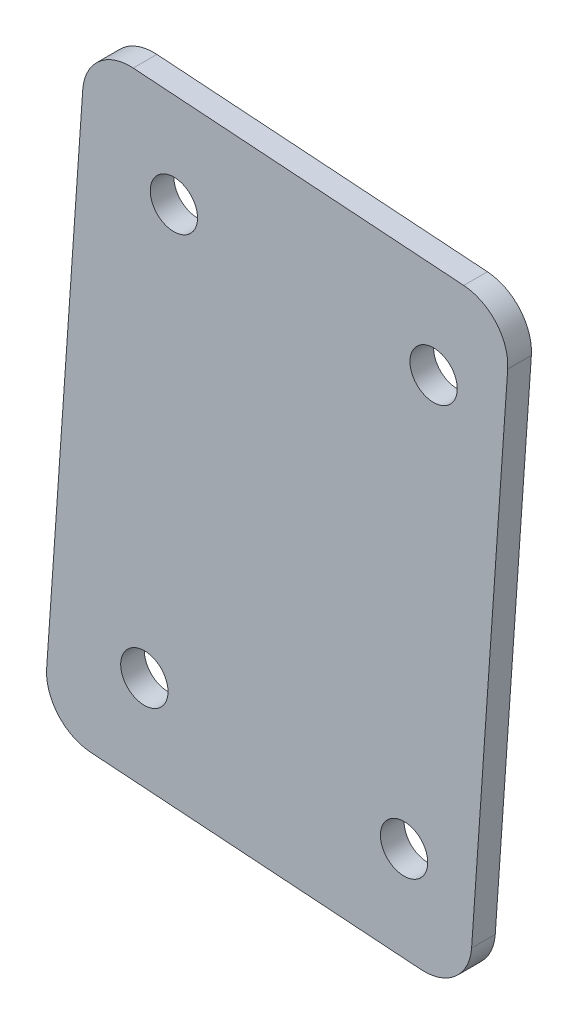
ISO-10303-21;
HEADER;
FILE_DESCRIPTION(('STEP AP214'),'2;1');
FILE_NAME('part.step','',(''),(''),'','','');
FILE_SCHEMA(('AUTOMOTIVE_DESIGN { 1 0 10303 214 1 1 1 1 }'));
ENDSEC;
DATA;
#1=APPLICATION_CONTEXT('core data for automotive mechanical design processes');
#2=APPLICATION_PROTOCOL_DEFINITION('international standard','automotive_design',2000,#1);
#3=PRODUCT_CONTEXT('',#1,'mechanical');
#4=PRODUCT('Part','Part','',(#3));
#5=PRODUCT_RELATED_PRODUCT_CATEGORY('part','',(#4));
#6=PRODUCT_DEFINITION_FORMATION('','',#4);
#7=PRODUCT_DEFINITION_CONTEXT('part definition',#1,'design');
#8=PRODUCT_DEFINITION('design','',#6,#7);
#9=PRODUCT_DEFINITION_SHAPE('','',#8);
#10=(LENGTH_UNIT() NAMED_UNIT(*) SI_UNIT(.MILLI.,.METRE.));
#11=(NAMED_UNIT(*) PLANE_ANGLE_UNIT() SI_UNIT($,.RADIAN.));
#12=(NAMED_UNIT(*) SI_UNIT($,.STERADIAN.) SOLID_ANGLE_UNIT());
#13=UNCERTAINTY_MEASURE_WITH_UNIT(LENGTH_MEASURE(1.E-05),#10,'distance_accuracy_value','');
#14=(GEOMETRIC_REPRESENTATION_CONTEXT(3) GLOBAL_UNCERTAINTY_ASSIGNED_CONTEXT((#13)) GLOBAL_UNIT_ASSIGNED_CONTEXT((#10,
#11,#12)) REPRESENTATION_CONTEXT('',''));
#15=CARTESIAN_POINT('',(0.,0.,0.));
#16=DIRECTION('',(0.,0.,1.));
#17=DIRECTION('',(1.,0.,0.));
#18=AXIS2_PLACEMENT_3D('',#15,#16,#17);
#19=CARTESIAN_POINT('',(0.,0.,3.175));
#20=DIRECTION('',(0.,0.,1.));
#21=DIRECTION('',(1.,0.,0.));
#22=AXIS2_PLACEMENT_3D('',#19,#20,#21);
#23=PLANE('',#22);
#24=CARTESIAN_POINT('',(-345.573737165275,274.679259269861,3.175));
#25=DIRECTION('',(0.,0.,1.));
#26=DIRECTION('',(1.,0.,0.));
#27=AXIS2_PLACEMENT_3D('',#24,#25,#26);
#28=CIRCLE('',#27,3.17500000000002);
#29=CARTESIAN_POINT('',(-342.398737165275,274.679259269861,3.175));
#30=VERTEX_POINT('',#29);
#31=EDGE_CURVE('E213',#30,#30,#28,.T.);
#32=ORIENTED_EDGE('',*,*,#31,.F.);
#33=EDGE_LOOP('',(#32));
#34=FACE_BOUND('',#33,.T.);
#35=CARTESIAN_POINT('',(-306.771270756679,329.270895310648,3.175));
#36=DIRECTION('',(0.,0.,1.));
#37=DIRECTION('',(1.,0.,0.));
#38=AXIS2_PLACEMENT_3D('',#35,#36,#37);
#39=CIRCLE('',#38,3.17499999999997);
#40=CARTESIAN_POINT('',(-303.596270756679,329.270895310648,3.175));
#41=VERTEX_POINT('',#40);
#42=EDGE_CURVE('E189',#41,#41,#39,.T.);
#43=ORIENTED_EDGE('',*,*,#42,.F.);
#44=EDGE_LOOP('',(#43));
#45=FACE_BOUND('',#44,.T.);
#46=DIRECTION('',(0.0693171008801701,0.997594676973353,0.));
#47=VECTOR('',#46,1.);
#48=CARTESIAN_POINT('',(-296.38885427733,341.280102322326,3.175));
#49=LINE('',#48,#47);
#50=CARTESIAN_POINT('',(-301.670817364398,265.263387936956,3.175));
#51=VERTEX_POINT('',#50);
#52=CARTESIAN_POINT('',(-296.829017867919,334.945376123545,3.175));
#53=VERTEX_POINT('',#52);
#54=EDGE_CURVE('E199',#51,#53,#49,.T.);
#55=ORIENTED_EDGE('',*,*,#54,.T.);
#56=CARTESIAN_POINT('',(-303.163744066699,335.385539714134,3.175));
#57=DIRECTION('',(0.,0.,1.));
#58=DIRECTION('',(1.,0.,0.));
#59=AXIS2_PLACEMENT_3D('',#56,#57,#58);
#60=CIRCLE('',#59,6.35);
#61=CARTESIAN_POINT('',(-302.72358047611,341.720265912915,3.175));
#62=VERTEX_POINT('',#61);
#63=EDGE_CURVE('E168',#53,#62,#60,.T.);
#64=ORIENTED_EDGE('',*,*,#63,.T.);
#65=DIRECTION('',(-0.997594676973353,0.0693171008801706,0.));
#66=VECTOR('',#65,1.);
#67=CARTESIAN_POINT('',(-353.401390066357,345.241574637627,3.175));
#68=LINE('',#67,#66);
#69=CARTESIAN_POINT('',(-347.066663867576,344.801411047038,3.175));
#70=VERTEX_POINT('',#69);
#71=EDGE_CURVE('E126',#62,#70,#68,.T.);
#72=ORIENTED_EDGE('',*,*,#71,.T.);
#73=CARTESIAN_POINT('',(-347.506827458165,338.466684848258,3.175));
#74=DIRECTION('',(0.,0.,1.));
#75=DIRECTION('',(1.,0.,0.));
#76=AXIS2_PLACEMENT_3D('',#73,#74,#75);
#77=CIRCLE('',#76,6.35);
#78=CARTESIAN_POINT('',(-353.841553656946,338.906848438847,3.175));
#79=VERTEX_POINT('',#78);
#80=EDGE_CURVE('E161',#70,#79,#77,.T.);
#81=ORIENTED_EDGE('',*,*,#80,.T.);
#82=DIRECTION('',(-0.0693171008801701,-0.997594676973353,0.));
#83=VECTOR('',#82,1.);
#84=CARTESIAN_POINT('',(-353.401390066357,345.241574637627,3.175));
#85=LINE('',#84,#83);
#86=CARTESIAN_POINT('',(-358.683353153426,269.224860252258,3.175));
#87=VERTEX_POINT('',#86);
#88=EDGE_CURVE('E135',#79,#87,#85,.T.);
#89=ORIENTED_EDGE('',*,*,#88,.T.);
#90=CARTESIAN_POINT('',(-352.348626954645,268.784696661669,3.175));
#91=DIRECTION('',(0.,0.,1.));
#92=DIRECTION('',(1.,0.,0.));
#93=AXIS2_PLACEMENT_3D('',#90,#91,#92);
#94=CIRCLE('',#93,6.35);
#95=CARTESIAN_POINT('',(-352.788790545234,262.449970462888,3.175));
#96=VERTEX_POINT('',#95);
#97=EDGE_CURVE('E61',#87,#96,#94,.T.);
#98=ORIENTED_EDGE('',*,*,#97,.T.);
#99=DIRECTION('',(0.997594676973353,-0.0693171008801706,0.));
#100=VECTOR('',#99,1.);
#101=CARTESIAN_POINT('',(-359.123516744015,262.890134053477,3.175));
#102=LINE('',#101,#100);
#103=CARTESIAN_POINT('',(-308.445707153768,259.368825328765,3.175));
#104=VERTEX_POINT('',#103);
#105=EDGE_CURVE('E140',#96,#104,#102,.T.);
#106=ORIENTED_EDGE('',*,*,#105,.T.);
#107=CARTESIAN_POINT('',(-308.005543563179,265.703551527545,3.175));
#108=DIRECTION('',(0.,0.,1.));
#109=DIRECTION('',(1.,0.,0.));
#110=AXIS2_PLACEMENT_3D('',#107,#108,#109);
#111=CIRCLE('',#110,6.35);
#112=EDGE_CURVE('E166',#104,#51,#111,.T.);
#113=ORIENTED_EDGE('',*,*,#112,.T.);
#114=EDGE_LOOP('',(#55,#64,#72,#81,#89,#98,#106,#113));
#115=FACE_BOUND('',#114,.T.);
#116=CARTESIAN_POINT('',(-341.612264849973,331.691795058888,3.175));
#117=DIRECTION('',(0.,0.,1.));
#118=DIRECTION('',(1.,0.,0.));
#119=AXIS2_PLACEMENT_3D('',#116,#117,#118);
#120=CIRCLE('',#119,3.17500000000002);
#121=CARTESIAN_POINT('',(-338.437264849973,331.691795058888,3.175));
#122=VERTEX_POINT('',#121);
#123=EDGE_CURVE('E207',#122,#122,#120,.T.);
#124=ORIENTED_EDGE('',*,*,#123,.F.);
#125=EDGE_LOOP('',(#124));
#126=FACE_BOUND('',#125,.T.);
#127=CARTESIAN_POINT('',(-310.732743071981,272.258359521621,3.175));
#128=DIRECTION('',(0.,0.,1.));
#129=DIRECTION('',(1.,0.,0.));
#130=AXIS2_PLACEMENT_3D('',#127,#128,#129);
#131=CIRCLE('',#130,3.17500000000002);
#132=CARTESIAN_POINT('',(-307.55774307198,272.258359521621,3.175));
#133=VERTEX_POINT('',#132);
#134=EDGE_CURVE('E221',#133,#133,#131,.T.);
#135=ORIENTED_EDGE('',*,*,#134,.F.);
#136=EDGE_LOOP('',(#135));
#137=FACE_BOUND('',#136,.T.);
#138=ADVANCED_FACE('F38',(#34,#45,#115,#126,#137),#23,.T.);
#139=CARTESIAN_POINT('',(0.,0.,0.));
#140=DIRECTION('',(0.,0.,1.));
#141=DIRECTION('',(1.,0.,0.));
#142=AXIS2_PLACEMENT_3D('',#139,#140,#141);
#143=PLANE('',#142);
#144=DIRECTION('',(-0.997594676973353,0.0693171008801706,0.));
#145=VECTOR('',#144,1.);
#146=CARTESIAN_POINT('',(-353.401390066357,345.241574637627,0.));
#147=LINE('',#146,#145);
#148=CARTESIAN_POINT('',(-302.72358047611,341.720265912915,0.));
#149=VERTEX_POINT('',#148);
#150=CARTESIAN_POINT('',(-347.066663867576,344.801411047038,0.));
#151=VERTEX_POINT('',#150);
#152=EDGE_CURVE('E123',#149,#151,#147,.T.);
#153=ORIENTED_EDGE('',*,*,#152,.F.);
#154=CARTESIAN_POINT('',(-303.163744066699,335.385539714134,0.));
#155=DIRECTION('',(0.,0.,1.));
#156=DIRECTION('',(1.,0.,0.));
#157=AXIS2_PLACEMENT_3D('',#154,#155,#156);
#158=CIRCLE('',#157,6.35);
#159=CARTESIAN_POINT('',(-296.829017867919,334.945376123545,0.));
#160=VERTEX_POINT('',#159);
#161=EDGE_CURVE('E105',#149,#160,#158,.F.);
#162=ORIENTED_EDGE('',*,*,#161,.T.);
#163=DIRECTION('',(0.0693171008801701,0.997594676973353,0.));
#164=VECTOR('',#163,1.);
#165=CARTESIAN_POINT('',(-296.38885427733,341.280102322326,0.));
#166=LINE('',#165,#164);
#167=CARTESIAN_POINT('',(-301.670817364398,265.263387936956,0.));
#168=VERTEX_POINT('',#167);
#169=EDGE_CURVE('E136',#168,#160,#166,.T.);
#170=ORIENTED_EDGE('',*,*,#169,.F.);
#171=CARTESIAN_POINT('',(-308.005543563179,265.703551527545,0.));
#172=DIRECTION('',(0.,0.,1.));
#173=DIRECTION('',(1.,0.,0.));
#174=AXIS2_PLACEMENT_3D('',#171,#172,#173);
#175=CIRCLE('',#174,6.35);
#176=CARTESIAN_POINT('',(-308.445707153768,259.368825328765,0.));
#177=VERTEX_POINT('',#176);
#178=EDGE_CURVE('E117',#168,#177,#175,.F.);
#179=ORIENTED_EDGE('',*,*,#178,.T.);
#180=DIRECTION('',(0.997594676973353,-0.0693171008801706,0.));
#181=VECTOR('',#180,1.);
#182=CARTESIAN_POINT('',(-359.123516744015,262.890134053477,0.));
#183=LINE('',#182,#181);
#184=CARTESIAN_POINT('',(-352.788790545234,262.449970462888,0.));
#185=VERTEX_POINT('',#184);
#186=EDGE_CURVE('E143',#185,#177,#183,.T.);
#187=ORIENTED_EDGE('',*,*,#186,.F.);
#188=CARTESIAN_POINT('',(-352.348626954645,268.784696661669,0.));
#189=DIRECTION('',(0.,0.,1.));
#190=DIRECTION('',(1.,0.,0.));
#191=AXIS2_PLACEMENT_3D('',#188,#189,#190);
#192=CIRCLE('',#191,6.35);
#193=CARTESIAN_POINT('',(-358.683353153426,269.224860252258,0.));
#194=VERTEX_POINT('',#193);
#195=EDGE_CURVE('E151',#185,#194,#192,.F.);
#196=ORIENTED_EDGE('',*,*,#195,.T.);
#197=DIRECTION('',(-0.0693171008801701,-0.997594676973353,0.));
#198=VECTOR('',#197,1.);
#199=CARTESIAN_POINT('',(-353.401390066357,345.241574637627,0.));
#200=LINE('',#199,#198);
#201=CARTESIAN_POINT('',(-353.841553656946,338.906848438847,0.));
#202=VERTEX_POINT('',#201);
#203=EDGE_CURVE('E183',#202,#194,#200,.T.);
#204=ORIENTED_EDGE('',*,*,#203,.F.);
#205=CARTESIAN_POINT('',(-347.506827458165,338.466684848258,0.));
#206=DIRECTION('',(0.,0.,1.));
#207=DIRECTION('',(1.,0.,0.));
#208=AXIS2_PLACEMENT_3D('',#205,#206,#207);
#209=CIRCLE('',#208,6.35);
#210=EDGE_CURVE('E128',#202,#151,#209,.F.);
#211=ORIENTED_EDGE('',*,*,#210,.T.);
#212=EDGE_LOOP('',(#153,#162,#170,#179,#187,#196,#204,#211));
#213=FACE_BOUND('',#212,.T.);
#214=CARTESIAN_POINT('',(-306.771270756679,329.270895310648,0.));
#215=DIRECTION('',(0.,0.,1.));
#216=DIRECTION('',(1.,0.,0.));
#217=AXIS2_PLACEMENT_3D('',#214,#215,#216);
#218=CIRCLE('',#217,3.17499999999997);
#219=CARTESIAN_POINT('',(-303.596270756679,329.270895310648,0.));
#220=VERTEX_POINT('',#219);
#221=EDGE_CURVE('E194',#220,#220,#218,.T.);
#222=ORIENTED_EDGE('',*,*,#221,.T.);
#223=EDGE_LOOP('',(#222));
#224=FACE_BOUND('',#223,.T.);
#225=CARTESIAN_POINT('',(-341.612264849973,331.691795058888,0.));
#226=DIRECTION('',(0.,0.,1.));
#227=DIRECTION('',(1.,0.,0.));
#228=AXIS2_PLACEMENT_3D('',#225,#226,#227);
#229=CIRCLE('',#228,3.17500000000002);
#230=CARTESIAN_POINT('',(-338.437264849973,331.691795058888,0.));
#231=VERTEX_POINT('',#230);
#232=EDGE_CURVE('E209',#231,#231,#229,.T.);
#233=ORIENTED_EDGE('',*,*,#232,.T.);
#234=EDGE_LOOP('',(#233));
#235=FACE_BOUND('',#234,.T.);
#236=CARTESIAN_POINT('',(-345.573737165275,274.679259269861,0.));
#237=DIRECTION('',(0.,0.,1.));
#238=DIRECTION('',(1.,0.,0.));
#239=AXIS2_PLACEMENT_3D('',#236,#237,#238);
#240=CIRCLE('',#239,3.17500000000002);
#241=CARTESIAN_POINT('',(-342.398737165275,274.679259269861,0.));
#242=VERTEX_POINT('',#241);
#243=EDGE_CURVE('E217',#242,#242,#240,.T.);
#244=ORIENTED_EDGE('',*,*,#243,.T.);
#245=EDGE_LOOP('',(#244));
#246=FACE_BOUND('',#245,.T.);
#247=CARTESIAN_POINT('',(-310.732743071981,272.258359521621,0.));
#248=DIRECTION('',(0.,0.,1.));
#249=DIRECTION('',(1.,0.,0.));
#250=AXIS2_PLACEMENT_3D('',#247,#248,#249);
#251=CIRCLE('',#250,3.17500000000002);
#252=CARTESIAN_POINT('',(-307.55774307198,272.258359521621,0.));
#253=VERTEX_POINT('',#252);
#254=EDGE_CURVE('E225',#253,#253,#251,.T.);
#255=ORIENTED_EDGE('',*,*,#254,.T.);
#256=EDGE_LOOP('',(#255));
#257=FACE_BOUND('',#256,.T.);
#258=ADVANCED_FACE('F131',(#213,#224,#235,#246,#257),#143,.F.);
#259=CARTESIAN_POINT('',(-353.401390066357,345.241574637627,3.175));
#260=DIRECTION('',(0.997594676973353,-0.0693171008801701,0.));
#261=DIRECTION('',(0.0693171008801701,0.997594676973353,0.));
#262=AXIS2_PLACEMENT_3D('',#259,#260,#261);
#263=PLANE('',#262);
#264=ORIENTED_EDGE('',*,*,#203,.T.);
#265=DIRECTION('',(0.,0.,-1.));
#266=VECTOR('',#265,1.);
#267=CARTESIAN_POINT('',(-358.683353153426,269.224860252258,3.175));
#268=LINE('',#267,#266);
#269=EDGE_CURVE('E11',#194,#87,#268,.F.);
#270=ORIENTED_EDGE('',*,*,#269,.T.);
#271=ORIENTED_EDGE('',*,*,#88,.F.);
#272=DIRECTION('',(0.,0.,-1.));
#273=VECTOR('',#272,1.);
#274=CARTESIAN_POINT('',(-353.841553656946,338.906848438847,3.175));
#275=LINE('',#274,#273);
#276=EDGE_CURVE('E47',#79,#202,#275,.T.);
#277=ORIENTED_EDGE('',*,*,#276,.T.);
#278=EDGE_LOOP('',(#264,#270,#271,#277));
#279=FACE_BOUND('',#278,.T.);
#280=ADVANCED_FACE('F182',(#279),#263,.F.);
#281=CARTESIAN_POINT('',(-359.123516744015,262.890134053477,3.175));
#282=DIRECTION('',(0.0693171008801706,0.997594676973353,0.));
#283=DIRECTION('',(-0.997594676973353,0.0693171008801706,0.));
#284=AXIS2_PLACEMENT_3D('',#281,#282,#283);
#285=PLANE('',#284);
#286=ORIENTED_EDGE('',*,*,#186,.T.);
#287=DIRECTION('',(0.,0.,-1.));
#288=VECTOR('',#287,1.);
#289=CARTESIAN_POINT('',(-308.445707153768,259.368825328765,3.175));
#290=LINE('',#289,#288);
#291=EDGE_CURVE('E54',#177,#104,#290,.F.);
#292=ORIENTED_EDGE('',*,*,#291,.T.);
#293=ORIENTED_EDGE('',*,*,#105,.F.);
#294=DIRECTION('',(0.,0.,-1.));
#295=VECTOR('',#294,1.);
#296=CARTESIAN_POINT('',(-352.788790545234,262.449970462888,3.175));
#297=LINE('',#296,#295);
#298=EDGE_CURVE('E171',#96,#185,#297,.T.);
#299=ORIENTED_EDGE('',*,*,#298,.T.);
#300=EDGE_LOOP('',(#286,#292,#293,#299));
#301=FACE_BOUND('',#300,.T.);
#302=ADVANCED_FACE('F254',(#301),#285,.F.);
#303=CARTESIAN_POINT('',(-296.38885427733,341.280102322326,3.175));
#304=DIRECTION('',(-0.997594676973353,0.0693171008801701,0.));
#305=DIRECTION('',(-0.0693171008801701,-0.997594676973353,0.));
#306=AXIS2_PLACEMENT_3D('',#303,#304,#305);
#307=PLANE('',#306);
#308=ORIENTED_EDGE('',*,*,#169,.T.);
#309=DIRECTION('',(0.,0.,-1.));
#310=VECTOR('',#309,1.);
#311=CARTESIAN_POINT('',(-296.829017867919,334.945376123545,3.175));
#312=LINE('',#311,#310);
#313=EDGE_CURVE('E110',#160,#53,#312,.F.);
#314=ORIENTED_EDGE('',*,*,#313,.T.);
#315=ORIENTED_EDGE('',*,*,#54,.F.);
#316=DIRECTION('',(0.,0.,-1.));
#317=VECTOR('',#316,1.);
#318=CARTESIAN_POINT('',(-301.670817364398,265.263387936956,3.175));
#319=LINE('',#318,#317);
#320=EDGE_CURVE('E116',#51,#168,#319,.T.);
#321=ORIENTED_EDGE('',*,*,#320,.T.);
#322=EDGE_LOOP('',(#308,#314,#315,#321));
#323=FACE_BOUND('',#322,.T.);
#324=ADVANCED_FACE('F251',(#323),#307,.F.);
#325=CARTESIAN_POINT('',(-353.401390066357,345.241574637627,3.175));
#326=DIRECTION('',(-0.0693171008801706,-0.997594676973353,0.));
#327=DIRECTION('',(0.997594676973353,-0.0693171008801706,0.));
#328=AXIS2_PLACEMENT_3D('',#325,#326,#327);
#329=PLANE('',#328);
#330=ORIENTED_EDGE('',*,*,#71,.F.);
#331=DIRECTION('',(0.,0.,-1.));
#332=VECTOR('',#331,1.);
#333=CARTESIAN_POINT('',(-302.72358047611,341.720265912915,3.175));
#334=LINE('',#333,#332);
#335=EDGE_CURVE('E109',#62,#149,#334,.T.);
#336=ORIENTED_EDGE('',*,*,#335,.T.);
#337=ORIENTED_EDGE('',*,*,#152,.T.);
#338=DIRECTION('',(0.,0.,-1.));
#339=VECTOR('',#338,1.);
#340=CARTESIAN_POINT('',(-347.066663867576,344.801411047038,3.175));
#341=LINE('',#340,#339);
#342=EDGE_CURVE('E129',#151,#70,#341,.F.);
#343=ORIENTED_EDGE('',*,*,#342,.T.);
#344=EDGE_LOOP('',(#330,#336,#337,#343));
#345=FACE_BOUND('',#344,.T.);
#346=ADVANCED_FACE('F122',(#345),#329,.F.);
#347=CARTESIAN_POINT('',(-306.771270756679,329.270895310648,3.175));
#348=DIRECTION('',(0.,0.,-1.));
#349=DIRECTION('',(-1.,0.,0.));
#350=AXIS2_PLACEMENT_3D('',#347,#348,#349);
#351=CYLINDRICAL_SURFACE('',#350,3.17499999999997);
#352=ORIENTED_EDGE('',*,*,#42,.T.);
#353=EDGE_LOOP('',(#352));
#354=FACE_BOUND('',#353,.T.);
#355=ORIENTED_EDGE('',*,*,#221,.F.);
#356=EDGE_LOOP('',(#355));
#357=FACE_BOUND('',#356,.T.);
#358=ADVANCED_FACE('F246',(#354,#357),#351,.F.);
#359=CARTESIAN_POINT('',(-341.612264849973,331.691795058888,3.175));
#360=DIRECTION('',(0.,0.,-1.));
#361=DIRECTION('',(-1.,0.,0.));
#362=AXIS2_PLACEMENT_3D('',#359,#360,#361);
#363=CYLINDRICAL_SURFACE('',#362,3.17500000000002);
#364=ORIENTED_EDGE('',*,*,#123,.T.);
#365=EDGE_LOOP('',(#364));
#366=FACE_BOUND('',#365,.T.);
#367=ORIENTED_EDGE('',*,*,#232,.F.);
#368=EDGE_LOOP('',(#367));
#369=FACE_BOUND('',#368,.T.);
#370=ADVANCED_FACE('F278',(#366,#369),#363,.F.);
#371=CARTESIAN_POINT('',(-345.573737165275,274.679259269861,3.175));
#372=DIRECTION('',(0.,0.,-1.));
#373=DIRECTION('',(-1.,0.,0.));
#374=AXIS2_PLACEMENT_3D('',#371,#372,#373);
#375=CYLINDRICAL_SURFACE('',#374,3.17500000000002);
#376=ORIENTED_EDGE('',*,*,#31,.T.);
#377=EDGE_LOOP('',(#376));
#378=FACE_BOUND('',#377,.T.);
#379=ORIENTED_EDGE('',*,*,#243,.F.);
#380=EDGE_LOOP('',(#379));
#381=FACE_BOUND('',#380,.T.);
#382=ADVANCED_FACE('F281',(#378,#381),#375,.F.);
#383=CARTESIAN_POINT('',(-310.732743071981,272.258359521621,3.175));
#384=DIRECTION('',(0.,0.,-1.));
#385=DIRECTION('',(-1.,0.,0.));
#386=AXIS2_PLACEMENT_3D('',#383,#384,#385);
#387=CYLINDRICAL_SURFACE('',#386,3.17500000000002);
#388=ORIENTED_EDGE('',*,*,#134,.T.);
#389=EDGE_LOOP('',(#388));
#390=FACE_BOUND('',#389,.T.);
#391=ORIENTED_EDGE('',*,*,#254,.F.);
#392=EDGE_LOOP('',(#391));
#393=FACE_BOUND('',#392,.T.);
#394=ADVANCED_FACE('F233',(#390,#393),#387,.F.);
#395=CARTESIAN_POINT('',(-303.163744066699,335.385539714134,3.175));
#396=DIRECTION('',(0.,0.,-1.));
#397=DIRECTION('',(-1.,0.,0.));
#398=AXIS2_PLACEMENT_3D('',#395,#396,#397);
#399=CYLINDRICAL_SURFACE('',#398,6.35);
#400=ORIENTED_EDGE('',*,*,#63,.F.);
#401=ORIENTED_EDGE('',*,*,#313,.F.);
#402=ORIENTED_EDGE('',*,*,#161,.F.);
#403=ORIENTED_EDGE('',*,*,#335,.F.);
#404=EDGE_LOOP('',(#400,#401,#402,#403));
#405=FACE_BOUND('',#404,.T.);
#406=ADVANCED_FACE('F108',(#405),#399,.T.);
#407=CARTESIAN_POINT('',(-308.005543563179,265.703551527545,3.175));
#408=DIRECTION('',(0.,0.,-1.));
#409=DIRECTION('',(-1.,0.,0.));
#410=AXIS2_PLACEMENT_3D('',#407,#408,#409);
#411=CYLINDRICAL_SURFACE('',#410,6.35);
#412=ORIENTED_EDGE('',*,*,#112,.F.);
#413=ORIENTED_EDGE('',*,*,#291,.F.);
#414=ORIENTED_EDGE('',*,*,#178,.F.);
#415=ORIENTED_EDGE('',*,*,#320,.F.);
#416=EDGE_LOOP('',(#412,#413,#414,#415));
#417=FACE_BOUND('',#416,.T.);
#418=ADVANCED_FACE('F262',(#417),#411,.T.);
#419=CARTESIAN_POINT('',(-352.348626954645,268.784696661669,3.175));
#420=DIRECTION('',(0.,0.,-1.));
#421=DIRECTION('',(-1.,0.,0.));
#422=AXIS2_PLACEMENT_3D('',#419,#420,#421);
#423=CYLINDRICAL_SURFACE('',#422,6.35);
#424=ORIENTED_EDGE('',*,*,#97,.F.);
#425=ORIENTED_EDGE('',*,*,#269,.F.);
#426=ORIENTED_EDGE('',*,*,#195,.F.);
#427=ORIENTED_EDGE('',*,*,#298,.F.);
#428=EDGE_LOOP('',(#424,#425,#426,#427));
#429=FACE_BOUND('',#428,.T.);
#430=ADVANCED_FACE('F264',(#429),#423,.T.);
#431=CARTESIAN_POINT('',(-347.506827458165,338.466684848258,3.175));
#432=DIRECTION('',(0.,0.,-1.));
#433=DIRECTION('',(-1.,0.,0.));
#434=AXIS2_PLACEMENT_3D('',#431,#432,#433);
#435=CYLINDRICAL_SURFACE('',#434,6.35);
#436=ORIENTED_EDGE('',*,*,#80,.F.);
#437=ORIENTED_EDGE('',*,*,#342,.F.);
#438=ORIENTED_EDGE('',*,*,#210,.F.);
#439=ORIENTED_EDGE('',*,*,#276,.F.);
#440=EDGE_LOOP('',(#436,#437,#438,#439));
#441=FACE_BOUND('',#440,.T.);
#442=ADVANCED_FACE('F40',(#441),#435,.T.);
#443=CLOSED_SHELL('',(#138,#258,#280,#302,#324,#346,#358,#370,#382,#394,#406,#418,#430,#442));
#444=MANIFOLD_SOLID_BREP('B2',#443);
#445=ADVANCED_BREP_SHAPE_REPRESENTATION('',(#18,#444),#14);
#446=SHAPE_DEFINITION_REPRESENTATION(#9,#445);
ENDSEC;
END-ISO-10303-21;
